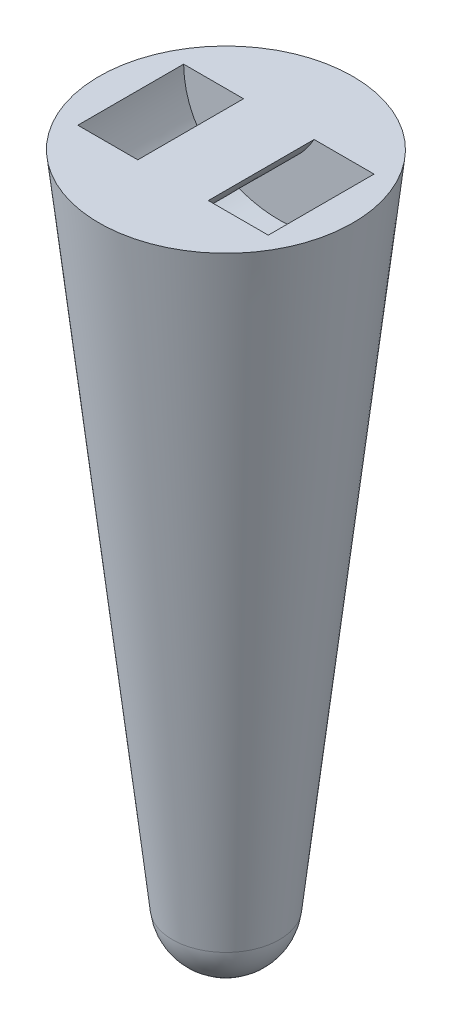
ISO-10303-21;
HEADER;
FILE_DESCRIPTION(('STEP AP214'),'2;1');
FILE_NAME('part.step','',(''),(''),'','','');
FILE_SCHEMA(('AUTOMOTIVE_DESIGN { 1 0 10303 214 1 1 1 1 }'));
ENDSEC;
DATA;
#1=APPLICATION_CONTEXT('core data for automotive mechanical design processes');
#2=APPLICATION_PROTOCOL_DEFINITION('international standard','automotive_design',2000,#1);
#3=PRODUCT_CONTEXT('',#1,'mechanical');
#4=PRODUCT('Part','Part','',(#3));
#5=PRODUCT_RELATED_PRODUCT_CATEGORY('part','',(#4));
#6=PRODUCT_DEFINITION_FORMATION('','',#4);
#7=PRODUCT_DEFINITION_CONTEXT('part definition',#1,'design');
#8=PRODUCT_DEFINITION('design','',#6,#7);
#9=PRODUCT_DEFINITION_SHAPE('','',#8);
#10=(LENGTH_UNIT() NAMED_UNIT(*) SI_UNIT(.MILLI.,.METRE.));
#11=(NAMED_UNIT(*) PLANE_ANGLE_UNIT() SI_UNIT($,.RADIAN.));
#12=(NAMED_UNIT(*) SI_UNIT($,.STERADIAN.) SOLID_ANGLE_UNIT());
#13=UNCERTAINTY_MEASURE_WITH_UNIT(LENGTH_MEASURE(1.E-05),#10,'distance_accuracy_value','');
#14=(GEOMETRIC_REPRESENTATION_CONTEXT(3) GLOBAL_UNCERTAINTY_ASSIGNED_CONTEXT((#13)) GLOBAL_UNIT_ASSIGNED_CONTEXT((#10,
#11,#12)) REPRESENTATION_CONTEXT('',''));
#15=CARTESIAN_POINT('',(0.,0.,0.));
#16=DIRECTION('',(0.,0.,1.));
#17=DIRECTION('',(1.,0.,0.));
#18=AXIS2_PLACEMENT_3D('',#15,#16,#17);
#19=CARTESIAN_POINT('',(8.88662467005781E-07,82.5563598506246,6.));
#20=DIRECTION('',(0.,0.,-1.));
#21=DIRECTION('',(-1.,0.,0.));
#22=AXIS2_PLACEMENT_3D('',#19,#20,#21);
#23=PLANE('',#22);
#24=DIRECTION('',(-1.,0.,0.));
#25=VECTOR('',#24,1.);
#26=CARTESIAN_POINT('',(-10.7999991113375,92.4438344511493,6.));
#27=LINE('',#26,#25);
#28=CARTESIAN_POINT('',(-3.99999911133753,92.4438344511493,6.));
#29=VERTEX_POINT('',#28);
#30=CARTESIAN_POINT('',(-10.7999991113375,92.4438344511493,6.));
#31=VERTEX_POINT('',#30);
#32=EDGE_CURVE('E90',#29,#31,#27,.T.);
#33=ORIENTED_EDGE('',*,*,#32,.F.);
#34=CARTESIAN_POINT('',(-3.99999911133753,92.4438344511493,6.));
#35=CARTESIAN_POINT('',(8.88662465748106E-07,85.6424327089057,6.));
#36=CARTESIAN_POINT('',(4.00000088866247,92.4438344511493,6.));
#37=B_SPLINE_CURVE_WITH_KNOTS('',2,(#34,#35,#36),.UNSPECIFIED.,.F.,.F.,(3,3),(0.,1.),.UNSPECIFIED.);
#38=CARTESIAN_POINT('',(4.00000088866247,92.4438344511493,6.));
#39=VERTEX_POINT('',#38);
#40=EDGE_CURVE('E80',#39,#29,#37,.F.);
#41=ORIENTED_EDGE('',*,*,#40,.F.);
#42=CARTESIAN_POINT('',(10.8000008886625,92.4438344511493,6.));
#43=VERTEX_POINT('',#42);
#44=EDGE_CURVE('E88',#43,#39,#27,.T.);
#45=ORIENTED_EDGE('',*,*,#44,.F.);
#46=CARTESIAN_POINT('',(-10.7999991113375,92.4438344511493,6.));
#47=CARTESIAN_POINT('',(-10.6328899439774,79.260534983783,6.));
#48=CARTESIAN_POINT('',(10.6328917213023,79.260534983783,6.));
#49=CARTESIAN_POINT('',(10.8000008886625,92.4438344511493,6.));
#50=B_SPLINE_CURVE_WITH_KNOTS('',3,(#46,#47,#48,#49),.UNSPECIFIED.,.F.,.F.,(4,4),(0.,1.),.UNSPECIFIED.);
#51=EDGE_CURVE('E100',#31,#43,#50,.T.);
#52=ORIENTED_EDGE('',*,*,#51,.F.);
#53=EDGE_LOOP('',(#33,#41,#45,#52));
#54=FACE_BOUND('',#53,.T.);
#55=ADVANCED_FACE('F36',(#54),#23,.T.);
#56=CARTESIAN_POINT('',(8.88662467005781E-07,82.5563598506246,-6.));
#57=DIRECTION('',(0.,0.,-1.));
#58=DIRECTION('',(-1.,0.,0.));
#59=AXIS2_PLACEMENT_3D('',#56,#57,#58);
#60=PLANE('',#59);
#61=CARTESIAN_POINT('',(-3.99999911133753,92.4438344511493,-6.));
#62=CARTESIAN_POINT('',(8.88662465748106E-07,85.6424327089057,-6.));
#63=CARTESIAN_POINT('',(4.00000088866247,92.4438344511493,-6.));
#64=B_SPLINE_CURVE_WITH_KNOTS('',2,(#61,#62,#63),.UNSPECIFIED.,.F.,.F.,(3,3),(0.,1.),.UNSPECIFIED.);
#65=CARTESIAN_POINT('',(-3.99999911133753,92.4438344511493,-6.));
#66=VERTEX_POINT('',#65);
#67=CARTESIAN_POINT('',(4.00000088866247,92.4438344511493,-6.));
#68=VERTEX_POINT('',#67);
#69=EDGE_CURVE('E82',#66,#68,#64,.T.);
#70=ORIENTED_EDGE('',*,*,#69,.F.);
#71=DIRECTION('',(-1.,0.,0.));
#72=VECTOR('',#71,1.);
#73=CARTESIAN_POINT('',(-10.7999991113375,92.4438344511493,-6.));
#74=LINE('',#73,#72);
#75=CARTESIAN_POINT('',(-10.7999991113375,92.4438344511493,-6.));
#76=VERTEX_POINT('',#75);
#77=EDGE_CURVE('E138',#66,#76,#74,.T.);
#78=ORIENTED_EDGE('',*,*,#77,.T.);
#79=CARTESIAN_POINT('',(-10.7999991113375,92.4438344511493,-6.));
#80=CARTESIAN_POINT('',(-10.6328899439774,79.260534983783,-6.));
#81=CARTESIAN_POINT('',(10.6328917213023,79.260534983783,-6.));
#82=CARTESIAN_POINT('',(10.8000008886625,92.4438344511493,-6.));
#83=B_SPLINE_CURVE_WITH_KNOTS('',3,(#79,#80,#81,#82),.UNSPECIFIED.,.F.,.F.,(4,4),(0.,1.),.UNSPECIFIED.);
#84=CARTESIAN_POINT('',(10.8000008886625,92.4438344511493,-6.));
#85=VERTEX_POINT('',#84);
#86=EDGE_CURVE('E137',#76,#85,#83,.T.);
#87=ORIENTED_EDGE('',*,*,#86,.T.);
#88=EDGE_CURVE('E59',#85,#68,#74,.T.);
#89=ORIENTED_EDGE('',*,*,#88,.T.);
#90=EDGE_LOOP('',(#70,#78,#87,#89));
#91=FACE_BOUND('',#90,.T.);
#92=ADVANCED_FACE('F113',(#91),#60,.F.);
#93=CARTESIAN_POINT('',(8.88662467005781E-07,92.4438344511493,0.));
#94=DIRECTION('',(0.,-1.,0.));
#95=DIRECTION('',(0.,0.,-1.));
#96=AXIS2_PLACEMENT_3D('',#93,#94,#95);
#97=PLANE('',#96);
#98=DIRECTION('',(0.,0.,-1.));
#99=VECTOR('',#98,1.);
#100=CARTESIAN_POINT('',(-3.99999911133753,92.4438344511493,14.4016));
#101=LINE('',#100,#99);
#102=EDGE_CURVE('E51',#29,#66,#101,.T.);
#103=ORIENTED_EDGE('',*,*,#102,.F.);
#104=ORIENTED_EDGE('',*,*,#32,.T.);
#105=DIRECTION('',(0.,0.,-1.));
#106=VECTOR('',#105,1.);
#107=CARTESIAN_POINT('',(-10.7999991113375,92.4438344511493,6.));
#108=LINE('',#107,#106);
#109=EDGE_CURVE('E96',#31,#76,#108,.T.);
#110=ORIENTED_EDGE('',*,*,#109,.T.);
#111=ORIENTED_EDGE('',*,*,#77,.F.);
#112=EDGE_LOOP('',(#103,#104,#110,#111));
#113=FACE_BOUND('',#112,.T.);
#114=CARTESIAN_POINT('',(8.88662467005781E-07,92.4438344511493,0.));
#115=DIRECTION('',(0.,-1.,0.));
#116=DIRECTION('',(0.,0.,-1.));
#117=AXIS2_PLACEMENT_3D('',#114,#115,#116);
#118=CIRCLE('',#117,14.4);
#119=CARTESIAN_POINT('',(8.88662467005781E-07,92.4438344511493,-14.4));
#120=VERTEX_POINT('',#119);
#121=EDGE_CURVE('E44',#120,#120,#118,.T.);
#122=ORIENTED_EDGE('',*,*,#121,.F.);
#123=EDGE_LOOP('',(#122));
#124=FACE_BOUND('',#123,.T.);
#125=ORIENTED_EDGE('',*,*,#44,.T.);
#126=DIRECTION('',(0.,0.,-1.));
#127=VECTOR('',#126,1.);
#128=CARTESIAN_POINT('',(4.00000088866247,92.4438344511493,14.4016));
#129=LINE('',#128,#127);
#130=EDGE_CURVE('E77',#39,#68,#129,.T.);
#131=ORIENTED_EDGE('',*,*,#130,.T.);
#132=ORIENTED_EDGE('',*,*,#88,.F.);
#133=DIRECTION('',(0.,0.,-1.));
#134=VECTOR('',#133,1.);
#135=CARTESIAN_POINT('',(10.8000008886625,92.4438344511493,6.));
#136=LINE('',#135,#134);
#137=EDGE_CURVE('E95',#43,#85,#136,.T.);
#138=ORIENTED_EDGE('',*,*,#137,.F.);
#139=EDGE_LOOP('',(#125,#131,#132,#138));
#140=FACE_BOUND('',#139,.T.);
#141=ADVANCED_FACE('F93',(#113,#124,#140),#97,.F.);
#142=CARTESIAN_POINT('',(8.88662467005781E-07,18.5559869066735,0.));
#143=DIRECTION('',(0.,-1.,0.));
#144=DIRECTION('',(-1.,0.,0.));
#145=AXIS2_PLACEMENT_3D('',#142,#143,#144);
#146=SPHERICAL_SURFACE('',#145,6.11215245552421);
#147=CARTESIAN_POINT('',(8.88662467005781E-07,17.8777557408558,0.));
#148=DIRECTION('',(0.,-1.,0.));
#149=DIRECTION('',(0.,0.,-1.));
#150=AXIS2_PLACEMENT_3D('',#147,#148,#149);
#151=CIRCLE('',#150,6.07440615412604);
#152=CARTESIAN_POINT('',(8.88662467005781E-07,17.8777557408558,-6.07440615412604));
#153=VERTEX_POINT('',#152);
#154=EDGE_CURVE('E11',#153,#153,#151,.T.);
#155=ORIENTED_EDGE('',*,*,#154,.T.);
#156=EDGE_LOOP('',(#155));
#157=FACE_BOUND('',#156,.T.);
#158=ADVANCED_FACE('F38',(#157),#146,.T.);
#159=CARTESIAN_POINT('',(8.88662467005781E-07,92.4438344511493,0.));
#160=DIRECTION('',(0.,1.,0.));
#161=DIRECTION('',(0.,0.,1.));
#162=AXIS2_PLACEMENT_3D('',#159,#160,#161);
#163=CONICAL_SURFACE('',#162,14.4,0.111193363332835);
#164=ORIENTED_EDGE('',*,*,#154,.F.);
#165=EDGE_LOOP('',(#164));
#166=FACE_BOUND('',#165,.T.);
#167=ORIENTED_EDGE('',*,*,#121,.T.);
#168=EDGE_LOOP('',(#167));
#169=FACE_BOUND('',#168,.T.);
#170=ADVANCED_FACE('F110',(#166,#169),#163,.T.);
#171=DIRECTION('',(0.,0.,-1.));
#172=VECTOR('',#171,1.);
#173=SURFACE_OF_LINEAR_EXTRUSION('',#50,#172);
#174=ORIENTED_EDGE('',*,*,#109,.F.);
#175=ORIENTED_EDGE('',*,*,#51,.T.);
#176=ORIENTED_EDGE('',*,*,#137,.T.);
#177=ORIENTED_EDGE('',*,*,#86,.F.);
#178=EDGE_LOOP('',(#174,#175,#176,#177));
#179=FACE_BOUND('',#178,.T.);
#180=ADVANCED_FACE('F127',(#179),#173,.T.);
#181=CARTESIAN_POINT('',(-3.99999911133753,92.4438344511493,14.4016));
#182=CARTESIAN_POINT('',(8.88662465748106E-07,85.6424327089057,14.4016));
#183=CARTESIAN_POINT('',(4.00000088866247,92.4438344511493,14.4016));
#184=B_SPLINE_CURVE_WITH_KNOTS('',2,(#181,#182,#183),.UNSPECIFIED.,.F.,.F.,(3,3),(0.,1.),.UNSPECIFIED.);
#185=DIRECTION('',(0.,0.,-1.));
#186=VECTOR('',#185,1.);
#187=SURFACE_OF_LINEAR_EXTRUSION('',#184,#186);
#188=ORIENTED_EDGE('',*,*,#130,.F.);
#189=ORIENTED_EDGE('',*,*,#40,.T.);
#190=ORIENTED_EDGE('',*,*,#102,.T.);
#191=ORIENTED_EDGE('',*,*,#69,.T.);
#192=EDGE_LOOP('',(#188,#189,#190,#191));
#193=FACE_BOUND('',#192,.T.);
#194=ADVANCED_FACE('F79',(#193),#187,.F.);
#195=CLOSED_SHELL('',(#55,#92,#141,#158,#170,#180,#194));
#196=MANIFOLD_SOLID_BREP('B2',#195);
#197=ADVANCED_BREP_SHAPE_REPRESENTATION('',(#18,#196),#14);
#198=SHAPE_DEFINITION_REPRESENTATION(#9,#197);
ENDSEC;
END-ISO-10303-21;
